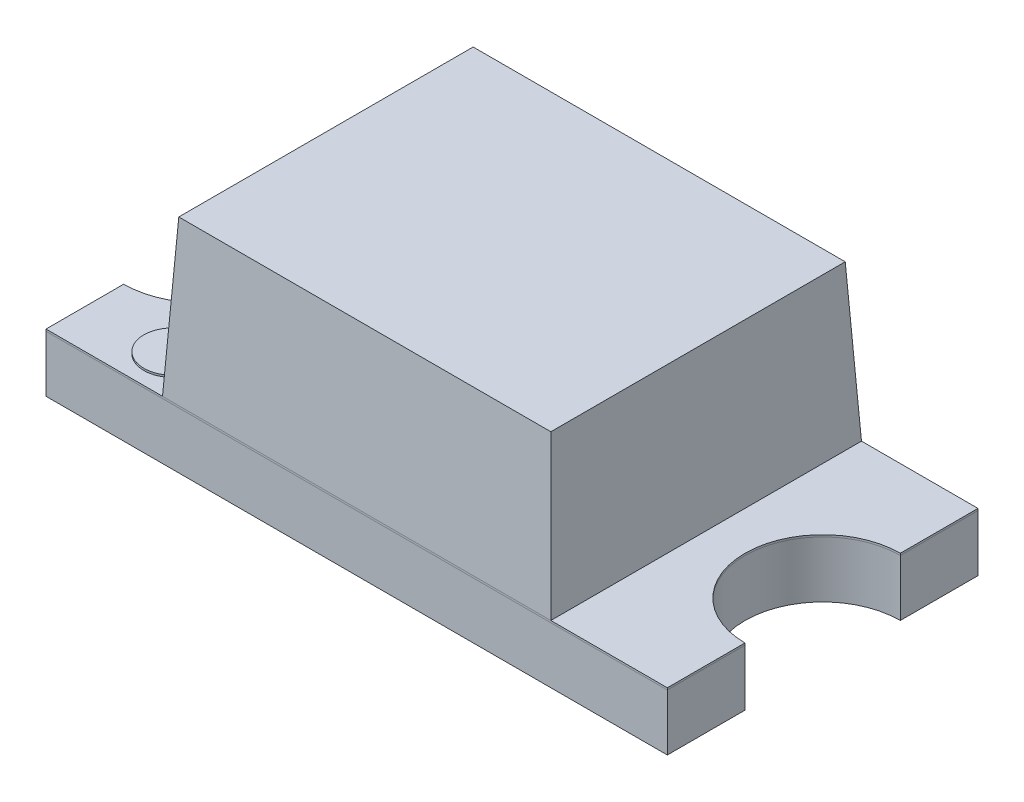
ISO-10303-21;
HEADER;
FILE_DESCRIPTION(('STEP AP214'),'2;1');
FILE_NAME('part.step','',(''),(''),'','','');
FILE_SCHEMA(('AUTOMOTIVE_DESIGN { 1 0 10303 214 1 1 1 1 }'));
ENDSEC;
DATA;
#1=APPLICATION_CONTEXT('core data for automotive mechanical design processes');
#2=APPLICATION_PROTOCOL_DEFINITION('international standard','automotive_design',2000,#1);
#3=PRODUCT_CONTEXT('',#1,'mechanical');
#4=PRODUCT('Part','Part','',(#3));
#5=PRODUCT_RELATED_PRODUCT_CATEGORY('part','',(#4));
#6=PRODUCT_DEFINITION_FORMATION('','',#4);
#7=PRODUCT_DEFINITION_CONTEXT('part definition',#1,'design');
#8=PRODUCT_DEFINITION('design','',#6,#7);
#9=PRODUCT_DEFINITION_SHAPE('','',#8);
#10=(LENGTH_UNIT() NAMED_UNIT(*) SI_UNIT(.MILLI.,.METRE.));
#11=(NAMED_UNIT(*) PLANE_ANGLE_UNIT() SI_UNIT($,.RADIAN.));
#12=(NAMED_UNIT(*) SI_UNIT($,.STERADIAN.) SOLID_ANGLE_UNIT());
#13=UNCERTAINTY_MEASURE_WITH_UNIT(LENGTH_MEASURE(1.E-05),#10,'distance_accuracy_value','');
#14=(GEOMETRIC_REPRESENTATION_CONTEXT(3) GLOBAL_UNCERTAINTY_ASSIGNED_CONTEXT((#13)) GLOBAL_UNIT_ASSIGNED_CONTEXT((#10,
#11,#12)) REPRESENTATION_CONTEXT('',''));
#15=CARTESIAN_POINT('',(0.,0.,0.));
#16=DIRECTION('',(0.,0.,1.));
#17=DIRECTION('',(1.,0.,0.));
#18=AXIS2_PLACEMENT_3D('',#15,#16,#17);
#19=CARTESIAN_POINT('',(-1.651758087201,0.,-0.190154711674));
#20=DIRECTION('',(0.,1.,0.));
#21=DIRECTION('',(0.,0.,1.));
#22=AXIS2_PLACEMENT_3D('',#19,#20,#21);
#23=PLANE('',#22);
#24=DIRECTION('',(0.,0.,1.));
#25=VECTOR('',#24,1.);
#26=CARTESIAN_POINT('',(1.548241912799,0.,-0.990154711674));
#27=LINE('',#26,#25);
#28=CARTESIAN_POINT('',(1.548241912799,0.,-0.990154711674));
#29=VERTEX_POINT('',#28);
#30=CARTESIAN_POINT('',(1.548241912799,0.,-0.590154711674));
#31=VERTEX_POINT('',#30);
#32=EDGE_CURVE('P0_E157',#29,#31,#27,.T.);
#33=ORIENTED_EDGE('',*,*,#32,.T.);
#34=CARTESIAN_POINT('',(1.548241912799,0.,-0.190154711674));
#35=DIRECTION('',(0.,-1.,0.));
#36=DIRECTION('',(0.,0.,-1.));
#37=AXIS2_PLACEMENT_3D('',#34,#35,#36);
#38=CIRCLE('',#37,0.4);
#39=CARTESIAN_POINT('',(1.548241912799,0.,0.209845288326));
#40=VERTEX_POINT('',#39);
#41=EDGE_CURVE('P0_E20',#40,#31,#38,.T.);
#42=ORIENTED_EDGE('',*,*,#41,.F.);
#43=DIRECTION('',(0.,0.,1.));
#44=VECTOR('',#43,1.);
#45=CARTESIAN_POINT('',(1.548241912799,0.,-0.190154711674));
#46=LINE('',#45,#44);
#47=CARTESIAN_POINT('',(1.548241912799,0.,0.609845288326));
#48=VERTEX_POINT('',#47);
#49=EDGE_CURVE('P0_E66',#48,#40,#46,.F.);
#50=ORIENTED_EDGE('',*,*,#49,.F.);
#51=DIRECTION('',(-1.,0.,0.));
#52=VECTOR('',#51,1.);
#53=CARTESIAN_POINT('',(-1.651758087201,0.,0.609845288326));
#54=LINE('',#53,#52);
#55=CARTESIAN_POINT('',(-1.651758087201,0.,0.609845288326));
#56=VERTEX_POINT('',#55);
#57=EDGE_CURVE('P0_E98',#48,#56,#54,.T.);
#58=ORIENTED_EDGE('',*,*,#57,.T.);
#59=DIRECTION('',(0.,0.,-1.));
#60=VECTOR('',#59,1.);
#61=CARTESIAN_POINT('',(-1.651758087201,0.,0.209845288326));
#62=LINE('',#61,#60);
#63=CARTESIAN_POINT('',(-1.651758087201,0.,0.209845288326));
#64=VERTEX_POINT('',#63);
#65=EDGE_CURVE('P0_E94',#56,#64,#62,.T.);
#66=ORIENTED_EDGE('',*,*,#65,.T.);
#67=CARTESIAN_POINT('',(-1.651758087201,0.,-0.190154711674));
#68=DIRECTION('',(0.,-1.,0.));
#69=DIRECTION('',(0.,0.,-1.));
#70=AXIS2_PLACEMENT_3D('',#67,#68,#69);
#71=CIRCLE('',#70,0.4);
#72=CARTESIAN_POINT('',(-1.651758087201,0.,-0.590154711674));
#73=VERTEX_POINT('',#72);
#74=EDGE_CURVE('P0_E143',#64,#73,#71,.F.);
#75=ORIENTED_EDGE('',*,*,#74,.T.);
#76=DIRECTION('',(0.,0.,-1.));
#77=VECTOR('',#76,1.);
#78=CARTESIAN_POINT('',(-1.651758087201,0.,-0.990154711674));
#79=LINE('',#78,#77);
#80=CARTESIAN_POINT('',(-1.651758087201,0.,-0.990154711674));
#81=VERTEX_POINT('',#80);
#82=EDGE_CURVE('P0_E146',#73,#81,#79,.T.);
#83=ORIENTED_EDGE('',*,*,#82,.T.);
#84=DIRECTION('',(1.,0.,0.));
#85=VECTOR('',#84,1.);
#86=CARTESIAN_POINT('',(-1.651758087201,0.,-0.990154711674));
#87=LINE('',#86,#85);
#88=EDGE_CURVE('P0_E72',#81,#29,#87,.T.);
#89=ORIENTED_EDGE('',*,*,#88,.T.);
#90=EDGE_LOOP('',(#33,#42,#50,#58,#66,#75,#83,#89));
#91=FACE_BOUND('',#90,.T.);
#92=ADVANCED_FACE('P0_F17',(#91),#23,.F.);
#93=CARTESIAN_POINT('',(1.548241912799,0.3,-0.990154711674));
#94=DIRECTION('',(-1.,0.,0.));
#95=DIRECTION('',(0.,0.,1.));
#96=AXIS2_PLACEMENT_3D('',#93,#94,#95);
#97=PLANE('',#96);
#98=ORIENTED_EDGE('',*,*,#32,.F.);
#99=DIRECTION('',(0.,1.,0.));
#100=VECTOR('',#99,1.);
#101=CARTESIAN_POINT('',(1.548241912799,0.3,-0.990154711674));
#102=LINE('',#101,#100);
#103=CARTESIAN_POINT('',(1.548241912799,0.29,-0.990154711674));
#104=VERTEX_POINT('',#103);
#105=EDGE_CURVE('P0_E153',#29,#104,#102,.T.);
#106=ORIENTED_EDGE('',*,*,#105,.T.);
#107=DIRECTION('',(0.,0.,1.));
#108=VECTOR('',#107,1.);
#109=CARTESIAN_POINT('',(1.548241912799,0.29,-0.190154711674));
#110=LINE('',#109,#108);
#111=CARTESIAN_POINT('',(1.548241912799,0.29,-0.590154711674));
#112=VERTEX_POINT('',#111);
#113=EDGE_CURVE('P0_E123',#112,#104,#110,.F.);
#114=ORIENTED_EDGE('',*,*,#113,.F.);
#115=DIRECTION('',(0.,-1.,0.));
#116=VECTOR('',#115,1.);
#117=CARTESIAN_POINT('',(1.548241912799,0.3,-0.590154711674));
#118=LINE('',#117,#116);
#119=EDGE_CURVE('P0_E129',#112,#31,#118,.T.);
#120=ORIENTED_EDGE('',*,*,#119,.T.);
#121=EDGE_LOOP('',(#98,#106,#114,#120));
#122=FACE_BOUND('',#121,.T.);
#123=ADVANCED_FACE('P0_F189',(#122),#97,.F.);
#124=CARTESIAN_POINT('',(-1.651758087201,0.3,-0.990154711674));
#125=DIRECTION('',(0.,0.,1.));
#126=DIRECTION('',(1.,0.,0.));
#127=AXIS2_PLACEMENT_3D('',#124,#125,#126);
#128=PLANE('',#127);
#129=ORIENTED_EDGE('',*,*,#88,.F.);
#130=DIRECTION('',(0.,1.,0.));
#131=VECTOR('',#130,1.);
#132=CARTESIAN_POINT('',(-1.651758087201,0.3,-0.990154711674));
#133=LINE('',#132,#131);
#134=CARTESIAN_POINT('',(-1.651758087201,0.29,-0.990154711674));
#135=VERTEX_POINT('',#134);
#136=EDGE_CURVE('P0_E144',#81,#135,#133,.T.);
#137=ORIENTED_EDGE('',*,*,#136,.T.);
#138=DIRECTION('',(1.,0.,0.));
#139=VECTOR('',#138,1.);
#140=CARTESIAN_POINT('',(1.548241912799,0.29,-0.990154711674));
#141=LINE('',#140,#139);
#142=EDGE_CURVE('P0_E120',#104,#135,#141,.F.);
#143=ORIENTED_EDGE('',*,*,#142,.F.);
#144=ORIENTED_EDGE('',*,*,#105,.F.);
#145=EDGE_LOOP('',(#129,#137,#143,#144));
#146=FACE_BOUND('',#145,.T.);
#147=ADVANCED_FACE('P0_F187',(#146),#128,.F.);
#148=CARTESIAN_POINT('',(-1.651758087201,0.3,-0.990154711674));
#149=DIRECTION('',(1.,0.,0.));
#150=DIRECTION('',(0.,0.,-1.));
#151=AXIS2_PLACEMENT_3D('',#148,#149,#150);
#152=PLANE('',#151);
#153=ORIENTED_EDGE('',*,*,#82,.F.);
#154=DIRECTION('',(0.,-1.,0.));
#155=VECTOR('',#154,1.);
#156=CARTESIAN_POINT('',(-1.651758087201,0.3,-0.590154711674));
#157=LINE('',#156,#155);
#158=CARTESIAN_POINT('',(-1.651758087201,0.29,-0.590154711674));
#159=VERTEX_POINT('',#158);
#160=EDGE_CURVE('P0_E141',#73,#159,#157,.F.);
#161=ORIENTED_EDGE('',*,*,#160,.T.);
#162=DIRECTION('',(0.,0.,1.));
#163=VECTOR('',#162,1.);
#164=CARTESIAN_POINT('',(-1.651758087201,0.29,-0.190154711674));
#165=LINE('',#164,#163);
#166=EDGE_CURVE('P0_E111',#135,#159,#165,.T.);
#167=ORIENTED_EDGE('',*,*,#166,.F.);
#168=ORIENTED_EDGE('',*,*,#136,.F.);
#169=EDGE_LOOP('',(#153,#161,#167,#168));
#170=FACE_BOUND('',#169,.T.);
#171=ADVANCED_FACE('P0_F181',(#170),#152,.F.);
#172=CARTESIAN_POINT('',(-1.651758087201,0.3,-0.190154711674));
#173=DIRECTION('',(0.,-1.,0.));
#174=DIRECTION('',(0.,0.,-1.));
#175=AXIS2_PLACEMENT_3D('',#172,#173,#174);
#176=CYLINDRICAL_SURFACE('',#175,0.4);
#177=ORIENTED_EDGE('',*,*,#74,.F.);
#178=DIRECTION('',(0.,1.,0.));
#179=VECTOR('',#178,1.);
#180=CARTESIAN_POINT('',(-1.651758087201,0.3,0.209845288326));
#181=LINE('',#180,#179);
#182=CARTESIAN_POINT('',(-1.651758087201,0.29,0.209845288326));
#183=VERTEX_POINT('',#182);
#184=EDGE_CURVE('P0_E139',#64,#183,#181,.T.);
#185=ORIENTED_EDGE('',*,*,#184,.T.);
#186=CARTESIAN_POINT('',(-1.651758087201,0.29,-0.190154711674));
#187=DIRECTION('',(0.,-1.,0.));
#188=DIRECTION('',(0.,0.,-1.));
#189=AXIS2_PLACEMENT_3D('',#186,#187,#188);
#190=CIRCLE('',#189,0.4);
#191=EDGE_CURVE('P0_E109',#159,#183,#190,.T.);
#192=ORIENTED_EDGE('',*,*,#191,.F.);
#193=ORIENTED_EDGE('',*,*,#160,.F.);
#194=EDGE_LOOP('',(#177,#185,#192,#193));
#195=FACE_BOUND('',#194,.T.);
#196=ADVANCED_FACE('P0_F183',(#195),#176,.F.);
#197=CARTESIAN_POINT('',(-1.651758087201,0.3,0.209845288326));
#198=DIRECTION('',(1.,0.,0.));
#199=DIRECTION('',(0.,0.,-1.));
#200=AXIS2_PLACEMENT_3D('',#197,#198,#199);
#201=PLANE('',#200);
#202=ORIENTED_EDGE('',*,*,#65,.F.);
#203=DIRECTION('',(0.,1.,0.));
#204=VECTOR('',#203,1.);
#205=CARTESIAN_POINT('',(-1.651758087201,0.3,0.609845288326));
#206=LINE('',#205,#204);
#207=CARTESIAN_POINT('',(-1.651758087201,0.29,0.609845288326));
#208=VERTEX_POINT('',#207);
#209=EDGE_CURVE('P0_E87',#56,#208,#206,.T.);
#210=ORIENTED_EDGE('',*,*,#209,.T.);
#211=DIRECTION('',(0.,0.,1.));
#212=VECTOR('',#211,1.);
#213=CARTESIAN_POINT('',(-1.651758087201,0.29,-0.190154711674));
#214=LINE('',#213,#212);
#215=EDGE_CURVE('P0_E92',#183,#208,#214,.T.);
#216=ORIENTED_EDGE('',*,*,#215,.F.);
#217=ORIENTED_EDGE('',*,*,#184,.F.);
#218=EDGE_LOOP('',(#202,#210,#216,#217));
#219=FACE_BOUND('',#218,.T.);
#220=ADVANCED_FACE('P0_F89',(#219),#201,.F.);
#221=CARTESIAN_POINT('',(-1.651758087201,0.3,0.609845288326));
#222=DIRECTION('',(0.,0.,-1.));
#223=DIRECTION('',(-1.,0.,0.));
#224=AXIS2_PLACEMENT_3D('',#221,#222,#223);
#225=PLANE('',#224);
#226=ORIENTED_EDGE('',*,*,#57,.F.);
#227=DIRECTION('',(0.,1.,0.));
#228=VECTOR('',#227,1.);
#229=CARTESIAN_POINT('',(1.548241912799,0.3,0.609845288326));
#230=LINE('',#229,#228);
#231=CARTESIAN_POINT('',(1.548241912799,0.29,0.609845288326));
#232=VERTEX_POINT('',#231);
#233=EDGE_CURVE('P0_E97',#48,#232,#230,.T.);
#234=ORIENTED_EDGE('',*,*,#233,.T.);
#235=DIRECTION('',(1.,0.,0.));
#236=VECTOR('',#235,1.);
#237=CARTESIAN_POINT('',(1.548241912799,0.29,0.609845288326));
#238=LINE('',#237,#236);
#239=EDGE_CURVE('P0_E101',#208,#232,#238,.T.);
#240=ORIENTED_EDGE('',*,*,#239,.F.);
#241=ORIENTED_EDGE('',*,*,#209,.F.);
#242=EDGE_LOOP('',(#226,#234,#240,#241));
#243=FACE_BOUND('',#242,.T.);
#244=ADVANCED_FACE('P0_F102',(#243),#225,.F.);
#245=CARTESIAN_POINT('',(1.548241912799,0.3,0.209845288326));
#246=DIRECTION('',(-1.,0.,0.));
#247=DIRECTION('',(0.,0.,1.));
#248=AXIS2_PLACEMENT_3D('',#245,#246,#247);
#249=PLANE('',#248);
#250=ORIENTED_EDGE('',*,*,#49,.T.);
#251=DIRECTION('',(0.,-1.,0.));
#252=VECTOR('',#251,1.);
#253=CARTESIAN_POINT('',(1.548241912799,0.3,0.209845288326));
#254=LINE('',#253,#252);
#255=CARTESIAN_POINT('',(1.548241912799,0.29,0.209845288326));
#256=VERTEX_POINT('',#255);
#257=EDGE_CURVE('P0_E35',#40,#256,#254,.F.);
#258=ORIENTED_EDGE('',*,*,#257,.T.);
#259=DIRECTION('',(0.,0.,1.));
#260=VECTOR('',#259,1.);
#261=CARTESIAN_POINT('',(1.548241912799,0.29,-0.190154711674));
#262=LINE('',#261,#260);
#263=EDGE_CURVE('P0_E26',#232,#256,#262,.F.);
#264=ORIENTED_EDGE('',*,*,#263,.F.);
#265=ORIENTED_EDGE('',*,*,#233,.F.);
#266=EDGE_LOOP('',(#250,#258,#264,#265));
#267=FACE_BOUND('',#266,.T.);
#268=ADVANCED_FACE('P0_F194',(#267),#249,.F.);
#269=CARTESIAN_POINT('',(1.548241912799,0.3,-0.190154711674));
#270=DIRECTION('',(0.,-1.,0.));
#271=DIRECTION('',(0.,0.,-1.));
#272=AXIS2_PLACEMENT_3D('',#269,#270,#271);
#273=CYLINDRICAL_SURFACE('',#272,0.4);
#274=ORIENTED_EDGE('',*,*,#41,.T.);
#275=ORIENTED_EDGE('',*,*,#119,.F.);
#276=CARTESIAN_POINT('',(1.548241912799,0.29,-0.190154711674));
#277=DIRECTION('',(0.,-1.,0.));
#278=DIRECTION('',(0.,0.,-1.));
#279=AXIS2_PLACEMENT_3D('',#276,#277,#278);
#280=CIRCLE('',#279,0.4);
#281=EDGE_CURVE('P0_E11',#256,#112,#280,.T.);
#282=ORIENTED_EDGE('',*,*,#281,.F.);
#283=ORIENTED_EDGE('',*,*,#257,.F.);
#284=EDGE_LOOP('',(#274,#275,#282,#283));
#285=FACE_BOUND('',#284,.T.);
#286=ADVANCED_FACE('P0_F195',(#285),#273,.F.);
#287=CARTESIAN_POINT('',(1.548241912799,0.29,-0.190154711674));
#288=DIRECTION('',(0.,1.,0.));
#289=DIRECTION('',(0.,0.,1.));
#290=AXIS2_PLACEMENT_3D('',#287,#288,#289);
#291=PLANE('',#290);
#292=ORIENTED_EDGE('',*,*,#263,.T.);
#293=ORIENTED_EDGE('',*,*,#281,.T.);
#294=ORIENTED_EDGE('',*,*,#113,.T.);
#295=ORIENTED_EDGE('',*,*,#142,.T.);
#296=ORIENTED_EDGE('',*,*,#166,.T.);
#297=ORIENTED_EDGE('',*,*,#191,.T.);
#298=ORIENTED_EDGE('',*,*,#215,.T.);
#299=ORIENTED_EDGE('',*,*,#239,.T.);
#300=EDGE_LOOP('',(#292,#293,#294,#295,#296,#297,#298,#299));
#301=FACE_BOUND('',#300,.T.);
#302=ADVANCED_FACE('P0_F106',(#301),#291,.T.);
#303=CLOSED_SHELL('',(#92,#123,#147,#171,#196,#220,#244,#268,#286,#302));
#304=MANIFOLD_SOLID_BREP('P0_B1',#303);
#305=CARTESIAN_POINT('',(-1.214532985657,0.31,0.393628401639));
#306=DIRECTION('',(0.,1.,0.));
#307=DIRECTION('',(0.,0.,1.));
#308=AXIS2_PLACEMENT_3D('',#305,#306,#307);
#309=PLANE('',#308);
#310=CARTESIAN_POINT('',(-1.214532985657,0.31,0.393628401639));
#311=DIRECTION('',(0.,-1.,0.));
#312=DIRECTION('',(0.,0.,-1.));
#313=AXIS2_PLACEMENT_3D('',#310,#311,#312);
#314=CIRCLE('',#313,0.149411676227);
#315=CARTESIAN_POINT('',(-1.214532985657,0.31,0.244216725412));
#316=VERTEX_POINT('',#315);
#317=EDGE_CURVE('P1_E20',#316,#316,#314,.T.);
#318=ORIENTED_EDGE('',*,*,#317,.F.);
#319=EDGE_LOOP('',(#318));
#320=FACE_BOUND('',#319,.T.);
#321=ADVANCED_FACE('P1_F17',(#320),#309,.T.);
#322=CARTESIAN_POINT('',(-1.214532985657,0.31,0.393628401639));
#323=DIRECTION('',(0.,-1.,0.));
#324=DIRECTION('',(0.,0.,-1.));
#325=AXIS2_PLACEMENT_3D('',#322,#323,#324);
#326=CYLINDRICAL_SURFACE('',#325,0.149411676227);
#327=ORIENTED_EDGE('',*,*,#317,.T.);
#328=EDGE_LOOP('',(#327));
#329=FACE_BOUND('',#328,.T.);
#330=CARTESIAN_POINT('',(-1.214532985657,0.3,0.393628401639));
#331=DIRECTION('',(0.,-1.,0.));
#332=DIRECTION('',(0.,0.,-1.));
#333=AXIS2_PLACEMENT_3D('',#330,#331,#332);
#334=CIRCLE('',#333,0.149411676227);
#335=CARTESIAN_POINT('',(-1.214532985657,0.3,0.244216725412));
#336=VERTEX_POINT('',#335);
#337=EDGE_CURVE('P1_E116',#336,#336,#334,.T.);
#338=ORIENTED_EDGE('',*,*,#337,.F.);
#339=EDGE_LOOP('',(#338));
#340=FACE_BOUND('',#339,.T.);
#341=ADVANCED_FACE('P1_F238',(#329,#340),#326,.T.);
#342=CARTESIAN_POINT('',(0.,1.1,0.));
#343=DIRECTION('',(0.,1.,0.));
#344=DIRECTION('',(0.,0.,1.));
#345=AXIS2_PLACEMENT_3D('',#342,#343,#344);
#346=PLANE('',#345);
#347=DIRECTION('',(0.,0.,1.));
#348=VECTOR('',#347,1.);
#349=CARTESIAN_POINT('',(-1.00983186377459,1.09999999999998,-0.990154711674));
#350=LINE('',#349,#348);
#351=CARTESIAN_POINT('',(-1.00983186377486,1.09999999999998,0.567919064899589));
#352=VERTEX_POINT('',#351);
#353=CARTESIAN_POINT('',(-1.00983186377479,1.1,-0.948228488247366));
#354=VERTEX_POINT('',#353);
#355=EDGE_CURVE('P1_E200',#352,#354,#350,.F.);
#356=ORIENTED_EDGE('',*,*,#355,.F.);
#357=DIRECTION('',(1.,0.,0.));
#358=VECTOR('',#357,1.);
#359=CARTESIAN_POINT('',(-1.051758087201,1.09999999999998,0.567919064899589));
#360=LINE('',#359,#358);
#361=CARTESIAN_POINT('',(0.906315689372195,1.1,0.567919064899589));
#362=VERTEX_POINT('',#361);
#363=EDGE_CURVE('P1_E180',#362,#352,#360,.F.);
#364=ORIENTED_EDGE('',*,*,#363,.F.);
#365=DIRECTION('',(0.,0.,1.));
#366=VECTOR('',#365,1.);
#367=CARTESIAN_POINT('',(0.906315689372586,1.10000000000003,-0.990154711674));
#368=LINE('',#367,#366);
#369=CARTESIAN_POINT('',(0.906315689372244,1.10000000000003,-0.94822848824744));
#370=VERTEX_POINT('',#369);
#371=EDGE_CURVE('P1_E198',#370,#362,#368,.T.);
#372=ORIENTED_EDGE('',*,*,#371,.F.);
#373=DIRECTION('',(1.,0.,0.));
#374=VECTOR('',#373,1.);
#375=CARTESIAN_POINT('',(-1.051758087201,1.10000000000003,-0.948228488247587));
#376=LINE('',#375,#374);
#377=EDGE_CURVE('P1_E164',#354,#370,#376,.T.);
#378=ORIENTED_EDGE('',*,*,#377,.F.);
#379=EDGE_LOOP('',(#356,#364,#372,#378));
#380=FACE_BOUND('',#379,.T.);
#381=ADVANCED_FACE('P1_F240',(#380),#346,.T.);
#382=CARTESIAN_POINT('',(0.948241912799,0.3,-0.990154711674));
#383=DIRECTION('',(0.998629534754575,0.0523359562429177,0.));
#384=DIRECTION('',(-0.0523359562429177,0.998629534754575,0.));
#385=AXIS2_PLACEMENT_3D('',#382,#383,#384);
#386=PLANE('',#385);
#387=DIRECTION('',(0.,0.,1.));
#388=VECTOR('',#387,1.);
#389=CARTESIAN_POINT('',(0.948241912799,0.3,-0.190154711674));
#390=LINE('',#389,#388);
#391=CARTESIAN_POINT('',(0.948241912799,0.3,-0.990154711674));
#392=VERTEX_POINT('',#391);
#393=CARTESIAN_POINT('',(0.948241912799,0.3,0.609845288326));
#394=VERTEX_POINT('',#393);
#395=EDGE_CURVE('P1_E162',#392,#394,#390,.T.);
#396=ORIENTED_EDGE('',*,*,#395,.F.);
#397=DIRECTION('',(0.0522644276894173,-0.997264688634202,-0.0522644276886859));
#398=VECTOR('',#397,1.);
#399=CARTESIAN_POINT('',(0.906315689372,1.10000000000003,-0.948228488247587));
#400=LINE('',#399,#398);
#401=EDGE_CURVE('P1_E190',#370,#392,#400,.T.);
#402=ORIENTED_EDGE('',*,*,#401,.F.);
#403=ORIENTED_EDGE('',*,*,#371,.T.);
#404=DIRECTION('',(-0.0522644276894206,0.997264688634202,-0.0522644276886859));
#405=VECTOR('',#404,1.);
#406=CARTESIAN_POINT('',(0.948241912799,0.3,0.609845288326));
#407=LINE('',#406,#405);
#408=EDGE_CURVE('P1_E157',#394,#362,#407,.T.);
#409=ORIENTED_EDGE('',*,*,#408,.F.);
#410=EDGE_LOOP('',(#396,#402,#403,#409));
#411=FACE_BOUND('',#410,.T.);
#412=ADVANCED_FACE('P1_F247',(#411),#386,.T.);
#413=CARTESIAN_POINT('',(-1.051758087201,0.3,-0.990154711674));
#414=DIRECTION('',(-0.998629534754575,0.0523359562429177,0.));
#415=DIRECTION('',(-0.0523359562429177,-0.998629534754575,0.));
#416=AXIS2_PLACEMENT_3D('',#413,#414,#415);
#417=PLANE('',#416);
#418=DIRECTION('',(0.,0.,1.));
#419=VECTOR('',#418,1.);
#420=CARTESIAN_POINT('',(-1.051758087201,0.3,-0.190154711674));
#421=LINE('',#420,#419);
#422=CARTESIAN_POINT('',(-1.051758087201,0.3,0.609845288326));
#423=VERTEX_POINT('',#422);
#424=CARTESIAN_POINT('',(-1.051758087201,0.3,-0.990154711674));
#425=VERTEX_POINT('',#424);
#426=EDGE_CURVE('P1_E181',#423,#425,#421,.F.);
#427=ORIENTED_EDGE('',*,*,#426,.F.);
#428=DIRECTION('',(-0.0522644276881771,-0.997264688634267,0.0522644276886894));
#429=VECTOR('',#428,1.);
#430=CARTESIAN_POINT('',(-1.009831863775,1.09999999999998,0.567919064899589));
#431=LINE('',#430,#429);
#432=EDGE_CURVE('P1_E169',#352,#423,#431,.T.);
#433=ORIENTED_EDGE('',*,*,#432,.F.);
#434=ORIENTED_EDGE('',*,*,#355,.T.);
#435=DIRECTION('',(0.0522644276881737,0.997264688634267,0.0522644276886893));
#436=VECTOR('',#435,1.);
#437=CARTESIAN_POINT('',(-1.051758087201,0.3,-0.990154711674));
#438=LINE('',#437,#436);
#439=EDGE_CURVE('P1_E146',#425,#354,#438,.T.);
#440=ORIENTED_EDGE('',*,*,#439,.F.);
#441=EDGE_LOOP('',(#427,#433,#434,#440));
#442=FACE_BOUND('',#441,.T.);
#443=ADVANCED_FACE('P1_F303',(#442),#417,.T.);
#444=CARTESIAN_POINT('',(1.548241912799,0.3,-0.190154711674));
#445=DIRECTION('',(0.,1.,0.));
#446=DIRECTION('',(0.,0.,1.));
#447=AXIS2_PLACEMENT_3D('',#444,#445,#446);
#448=PLANE('',#447);
#449=DIRECTION('',(0.,0.,1.));
#450=VECTOR('',#449,1.);
#451=CARTESIAN_POINT('',(-1.651758087201,0.3,-0.590154711674));
#452=LINE('',#451,#450);
#453=CARTESIAN_POINT('',(-1.651758087201,0.3,-0.590154711674));
#454=VERTEX_POINT('',#453);
#455=CARTESIAN_POINT('',(-1.651758087201,0.3,-0.990154711674));
#456=VERTEX_POINT('',#455);
#457=EDGE_CURVE('P1_E121',#454,#456,#452,.F.);
#458=ORIENTED_EDGE('',*,*,#457,.F.);
#459=CARTESIAN_POINT('',(-1.651758087201,0.3,-0.190154711674));
#460=DIRECTION('',(0.,1.,0.));
#461=DIRECTION('',(0.,0.,1.));
#462=AXIS2_PLACEMENT_3D('',#459,#460,#461);
#463=CIRCLE('',#462,0.4);
#464=CARTESIAN_POINT('',(-1.651758087201,0.3,0.209845288326));
#465=VERTEX_POINT('',#464);
#466=EDGE_CURVE('P1_E102',#454,#465,#463,.F.);
#467=ORIENTED_EDGE('',*,*,#466,.T.);
#468=DIRECTION('',(0.,0.,1.));
#469=VECTOR('',#468,1.);
#470=CARTESIAN_POINT('',(-1.651758087201,0.3,-0.190154711674));
#471=LINE('',#470,#469);
#472=CARTESIAN_POINT('',(-1.651758087201,0.3,0.609845288326));
#473=VERTEX_POINT('',#472);
#474=EDGE_CURVE('P1_E107',#465,#473,#471,.T.);
#475=ORIENTED_EDGE('',*,*,#474,.T.);
#476=DIRECTION('',(1.,0.,0.));
#477=VECTOR('',#476,1.);
#478=CARTESIAN_POINT('',(1.548241912799,0.3,0.609845288326));
#479=LINE('',#478,#477);
#480=EDGE_CURVE('P1_E115',#473,#423,#479,.T.);
#481=ORIENTED_EDGE('',*,*,#480,.T.);
#482=ORIENTED_EDGE('',*,*,#426,.T.);
#483=DIRECTION('',(1.,0.,0.));
#484=VECTOR('',#483,1.);
#485=CARTESIAN_POINT('',(1.548241912799,0.3,-0.990154711674));
#486=LINE('',#485,#484);
#487=EDGE_CURVE('P1_E178',#425,#456,#486,.F.);
#488=ORIENTED_EDGE('',*,*,#487,.T.);
#489=EDGE_LOOP('',(#458,#467,#475,#481,#482,#488));
#490=FACE_BOUND('',#489,.T.);
#491=ORIENTED_EDGE('',*,*,#337,.T.);
#492=EDGE_LOOP('',(#491));
#493=FACE_BOUND('',#492,.T.);
#494=ADVANCED_FACE('P1_F118',(#490,#493),#448,.T.);
#495=CARTESIAN_POINT('',(-1.051758087201,0.3,0.609845288326));
#496=DIRECTION('',(0.,0.0523359562429177,0.998629534754575));
#497=DIRECTION('',(0.,-0.998629534754575,0.0523359562429177));
#498=AXIS2_PLACEMENT_3D('',#495,#496,#497);
#499=PLANE('',#498);
#500=DIRECTION('',(1.,0.,0.));
#501=VECTOR('',#500,1.);
#502=CARTESIAN_POINT('',(-1.651758087201,0.3,0.609845288326));
#503=LINE('',#502,#501);
#504=EDGE_CURVE('P1_E132',#394,#423,#503,.F.);
#505=ORIENTED_EDGE('',*,*,#504,.F.);
#506=ORIENTED_EDGE('',*,*,#408,.T.);
#507=ORIENTED_EDGE('',*,*,#363,.T.);
#508=ORIENTED_EDGE('',*,*,#432,.T.);
#509=EDGE_LOOP('',(#505,#506,#507,#508));
#510=FACE_BOUND('',#509,.T.);
#511=ADVANCED_FACE('P1_F296',(#510),#499,.T.);
#512=CARTESIAN_POINT('',(1.548241912799,0.3,-0.190154711674));
#513=DIRECTION('',(0.,1.,0.));
#514=DIRECTION('',(0.,0.,1.));
#515=AXIS2_PLACEMENT_3D('',#512,#513,#514);
#516=PLANE('',#515);
#517=DIRECTION('',(0.,0.,-1.));
#518=VECTOR('',#517,1.);
#519=CARTESIAN_POINT('',(1.548241912799,0.3,0.609845288326));
#520=LINE('',#519,#518);
#521=CARTESIAN_POINT('',(1.548241912799,0.3,0.209845288326));
#522=VERTEX_POINT('',#521);
#523=CARTESIAN_POINT('',(1.548241912799,0.3,0.609845288326));
#524=VERTEX_POINT('',#523);
#525=EDGE_CURVE('P1_E149',#522,#524,#520,.F.);
#526=ORIENTED_EDGE('',*,*,#525,.F.);
#527=CARTESIAN_POINT('',(1.548241912799,0.3,-0.190154711674));
#528=DIRECTION('',(0.,1.,0.));
#529=DIRECTION('',(0.,0.,1.));
#530=AXIS2_PLACEMENT_3D('',#527,#528,#529);
#531=CIRCLE('',#530,0.4);
#532=CARTESIAN_POINT('',(1.548241912799,0.3,-0.590154711674));
#533=VERTEX_POINT('',#532);
#534=EDGE_CURVE('P1_E232',#522,#533,#531,.F.);
#535=ORIENTED_EDGE('',*,*,#534,.T.);
#536=DIRECTION('',(0.,0.,1.));
#537=VECTOR('',#536,1.);
#538=CARTESIAN_POINT('',(1.548241912799,0.3,-0.190154711674));
#539=LINE('',#538,#537);
#540=CARTESIAN_POINT('',(1.548241912799,0.3,-0.990154711674));
#541=VERTEX_POINT('',#540);
#542=EDGE_CURVE('P1_E154',#533,#541,#539,.F.);
#543=ORIENTED_EDGE('',*,*,#542,.T.);
#544=DIRECTION('',(1.,0.,0.));
#545=VECTOR('',#544,1.);
#546=CARTESIAN_POINT('',(1.548241912799,0.3,-0.990154711674));
#547=LINE('',#546,#545);
#548=EDGE_CURVE('P1_E156',#541,#392,#547,.F.);
#549=ORIENTED_EDGE('',*,*,#548,.T.);
#550=ORIENTED_EDGE('',*,*,#395,.T.);
#551=DIRECTION('',(1.,0.,0.));
#552=VECTOR('',#551,1.);
#553=CARTESIAN_POINT('',(-1.651758087201,0.3,0.609845288326));
#554=LINE('',#553,#552);
#555=EDGE_CURVE('P1_E129',#524,#394,#554,.F.);
#556=ORIENTED_EDGE('',*,*,#555,.F.);
#557=EDGE_LOOP('',(#526,#535,#543,#549,#550,#556));
#558=FACE_BOUND('',#557,.T.);
#559=ADVANCED_FACE('P1_F292',(#558),#516,.T.);
#560=CARTESIAN_POINT('',(-1.051758087201,0.3,-0.990154711674));
#561=DIRECTION('',(0.,0.0523359562429177,-0.998629534754575));
#562=DIRECTION('',(0.,0.998629534754575,0.0523359562429177));
#563=AXIS2_PLACEMENT_3D('',#560,#561,#562);
#564=PLANE('',#563);
#565=DIRECTION('',(-1.,0.,0.));
#566=VECTOR('',#565,1.);
#567=CARTESIAN_POINT('',(-1.651758087201,0.3,-0.990154711674));
#568=LINE('',#567,#566);
#569=EDGE_CURVE('P1_E184',#425,#392,#568,.F.);
#570=ORIENTED_EDGE('',*,*,#569,.F.);
#571=ORIENTED_EDGE('',*,*,#439,.T.);
#572=ORIENTED_EDGE('',*,*,#377,.T.);
#573=ORIENTED_EDGE('',*,*,#401,.T.);
#574=EDGE_LOOP('',(#570,#571,#572,#573));
#575=FACE_BOUND('',#574,.T.);
#576=ADVANCED_FACE('P1_F288',(#575),#564,.T.);
#577=CARTESIAN_POINT('',(-1.651758087201,0.29,-0.590154711674));
#578=DIRECTION('',(-1.,0.,0.));
#579=DIRECTION('',(0.,0.,1.));
#580=AXIS2_PLACEMENT_3D('',#577,#578,#579);
#581=PLANE('',#580);
#582=ORIENTED_EDGE('',*,*,#457,.T.);
#583=DIRECTION('',(0.,1.,0.));
#584=VECTOR('',#583,1.);
#585=CARTESIAN_POINT('',(-1.651758087201,0.29,-0.990154711674));
#586=LINE('',#585,#584);
#587=CARTESIAN_POINT('',(-1.651758087201,0.29,-0.990154711674));
#588=VERTEX_POINT('',#587);
#589=EDGE_CURVE('P1_E139',#588,#456,#586,.T.);
#590=ORIENTED_EDGE('',*,*,#589,.F.);
#591=DIRECTION('',(0.,0.,1.));
#592=VECTOR('',#591,1.);
#593=CARTESIAN_POINT('',(-1.651758087201,0.29,-0.190154711674));
#594=LINE('',#593,#592);
#595=CARTESIAN_POINT('',(-1.651758087201,0.29,-0.590154711674));
#596=VERTEX_POINT('',#595);
#597=EDGE_CURVE('P1_E142',#588,#596,#594,.T.);
#598=ORIENTED_EDGE('',*,*,#597,.T.);
#599=DIRECTION('',(0.,1.,0.));
#600=VECTOR('',#599,1.);
#601=CARTESIAN_POINT('',(-1.651758087201,0.29,-0.590154711674));
#602=LINE('',#601,#600);
#603=EDGE_CURVE('P1_E123',#596,#454,#602,.T.);
#604=ORIENTED_EDGE('',*,*,#603,.T.);
#605=EDGE_LOOP('',(#582,#590,#598,#604));
#606=FACE_BOUND('',#605,.T.);
#607=ADVANCED_FACE('P1_F285',(#606),#581,.T.);
#608=CARTESIAN_POINT('',(-1.651758087201,0.29,-0.190154711674));
#609=DIRECTION('',(0.,1.,0.));
#610=DIRECTION('',(0.,0.,1.));
#611=AXIS2_PLACEMENT_3D('',#608,#609,#610);
#612=CYLINDRICAL_SURFACE('',#611,0.4);
#613=CARTESIAN_POINT('',(-1.651758087201,0.29,-0.190154711674));
#614=DIRECTION('',(0.,1.,0.));
#615=DIRECTION('',(0.,0.,1.));
#616=AXIS2_PLACEMENT_3D('',#613,#614,#615);
#617=CIRCLE('',#616,0.4);
#618=CARTESIAN_POINT('',(-1.651758087201,0.29,0.209845288326));
#619=VERTEX_POINT('',#618);
#620=EDGE_CURVE('P1_E128',#596,#619,#617,.F.);
#621=ORIENTED_EDGE('',*,*,#620,.T.);
#622=DIRECTION('',(0.,1.,0.));
#623=VECTOR('',#622,1.);
#624=CARTESIAN_POINT('',(-1.651758087201,0.29,0.209845288326));
#625=LINE('',#624,#623);
#626=EDGE_CURVE('P1_E110',#465,#619,#625,.F.);
#627=ORIENTED_EDGE('',*,*,#626,.F.);
#628=ORIENTED_EDGE('',*,*,#466,.F.);
#629=ORIENTED_EDGE('',*,*,#603,.F.);
#630=EDGE_LOOP('',(#621,#627,#628,#629));
#631=FACE_BOUND('',#630,.T.);
#632=ADVANCED_FACE('P1_F126',(#631),#612,.F.);
#633=CARTESIAN_POINT('',(-1.651758087201,0.29,0.209845288326));
#634=DIRECTION('',(-1.,0.,0.));
#635=DIRECTION('',(0.,0.,1.));
#636=AXIS2_PLACEMENT_3D('',#633,#634,#635);
#637=PLANE('',#636);
#638=ORIENTED_EDGE('',*,*,#474,.F.);
#639=ORIENTED_EDGE('',*,*,#626,.T.);
#640=DIRECTION('',(0.,0.,1.));
#641=VECTOR('',#640,1.);
#642=CARTESIAN_POINT('',(-1.651758087201,0.29,-0.190154711674));
#643=LINE('',#642,#641);
#644=CARTESIAN_POINT('',(-1.651758087201,0.29,0.609845288326));
#645=VERTEX_POINT('',#644);
#646=EDGE_CURVE('P1_E231',#619,#645,#643,.T.);
#647=ORIENTED_EDGE('',*,*,#646,.T.);
#648=DIRECTION('',(0.,1.,0.));
#649=VECTOR('',#648,1.);
#650=CARTESIAN_POINT('',(-1.651758087201,0.29,0.609845288326));
#651=LINE('',#650,#649);
#652=EDGE_CURVE('P1_E112',#473,#645,#651,.F.);
#653=ORIENTED_EDGE('',*,*,#652,.F.);
#654=EDGE_LOOP('',(#638,#639,#647,#653));
#655=FACE_BOUND('',#654,.T.);
#656=ADVANCED_FACE('P1_F108',(#655),#637,.T.);
#657=CARTESIAN_POINT('',(-1.651758087201,0.29,0.609845288326));
#658=DIRECTION('',(0.,0.,1.));
#659=DIRECTION('',(1.,0.,0.));
#660=AXIS2_PLACEMENT_3D('',#657,#658,#659);
#661=PLANE('',#660);
#662=DIRECTION('',(1.,0.,0.));
#663=VECTOR('',#662,1.);
#664=CARTESIAN_POINT('',(1.548241912799,0.29,0.609845288326));
#665=LINE('',#664,#663);
#666=CARTESIAN_POINT('',(1.548241912799,0.29,0.609845288326));
#667=VERTEX_POINT('',#666);
#668=EDGE_CURVE('P1_E320',#645,#667,#665,.T.);
#669=ORIENTED_EDGE('',*,*,#668,.T.);
#670=DIRECTION('',(0.,1.,0.));
#671=VECTOR('',#670,1.);
#672=CARTESIAN_POINT('',(1.548241912799,0.29,0.609845288326));
#673=LINE('',#672,#671);
#674=EDGE_CURVE('P1_E151',#524,#667,#673,.F.);
#675=ORIENTED_EDGE('',*,*,#674,.F.);
#676=ORIENTED_EDGE('',*,*,#555,.T.);
#677=ORIENTED_EDGE('',*,*,#504,.T.);
#678=ORIENTED_EDGE('',*,*,#480,.F.);
#679=ORIENTED_EDGE('',*,*,#652,.T.);
#680=EDGE_LOOP('',(#669,#675,#676,#677,#678,#679));
#681=FACE_BOUND('',#680,.T.);
#682=ADVANCED_FACE('P1_F276',(#681),#661,.T.);
#683=CARTESIAN_POINT('',(1.548241912799,0.29,0.609845288326));
#684=DIRECTION('',(1.,0.,0.));
#685=DIRECTION('',(0.,0.,-1.));
#686=AXIS2_PLACEMENT_3D('',#683,#684,#685);
#687=PLANE('',#686);
#688=ORIENTED_EDGE('',*,*,#525,.T.);
#689=ORIENTED_EDGE('',*,*,#674,.T.);
#690=DIRECTION('',(0.,0.,1.));
#691=VECTOR('',#690,1.);
#692=CARTESIAN_POINT('',(1.548241912799,0.29,-0.190154711674));
#693=LINE('',#692,#691);
#694=CARTESIAN_POINT('',(1.548241912799,0.29,0.209845288326));
#695=VERTEX_POINT('',#694);
#696=EDGE_CURVE('P1_E229',#667,#695,#693,.F.);
#697=ORIENTED_EDGE('',*,*,#696,.T.);
#698=DIRECTION('',(0.,1.,0.));
#699=VECTOR('',#698,1.);
#700=CARTESIAN_POINT('',(1.548241912799,0.29,0.209845288326));
#701=LINE('',#700,#699);
#702=EDGE_CURVE('P1_E234',#695,#522,#701,.T.);
#703=ORIENTED_EDGE('',*,*,#702,.T.);
#704=EDGE_LOOP('',(#688,#689,#697,#703));
#705=FACE_BOUND('',#704,.T.);
#706=ADVANCED_FACE('P1_F272',(#705),#687,.T.);
#707=CARTESIAN_POINT('',(1.548241912799,0.29,-0.190154711674));
#708=DIRECTION('',(0.,1.,0.));
#709=DIRECTION('',(0.,0.,1.));
#710=AXIS2_PLACEMENT_3D('',#707,#708,#709);
#711=CYLINDRICAL_SURFACE('',#710,0.4);
#712=CARTESIAN_POINT('',(1.548241912799,0.29,-0.190154711674));
#713=DIRECTION('',(0.,1.,0.));
#714=DIRECTION('',(0.,0.,1.));
#715=AXIS2_PLACEMENT_3D('',#712,#713,#714);
#716=CIRCLE('',#715,0.4);
#717=CARTESIAN_POINT('',(1.548241912799,0.29,-0.590154711674));
#718=VERTEX_POINT('',#717);
#719=EDGE_CURVE('P1_E226',#695,#718,#716,.F.);
#720=ORIENTED_EDGE('',*,*,#719,.T.);
#721=DIRECTION('',(0.,1.,0.));
#722=VECTOR('',#721,1.);
#723=CARTESIAN_POINT('',(1.548241912799,0.29,-0.590154711674));
#724=LINE('',#723,#722);
#725=EDGE_CURVE('P1_E187',#533,#718,#724,.F.);
#726=ORIENTED_EDGE('',*,*,#725,.F.);
#727=ORIENTED_EDGE('',*,*,#534,.F.);
#728=ORIENTED_EDGE('',*,*,#702,.F.);
#729=EDGE_LOOP('',(#720,#726,#727,#728));
#730=FACE_BOUND('',#729,.T.);
#731=ADVANCED_FACE('P1_F268',(#730),#711,.F.);
#732=CARTESIAN_POINT('',(1.548241912799,0.29,-0.990154711674));
#733=DIRECTION('',(1.,0.,0.));
#734=DIRECTION('',(0.,0.,-1.));
#735=AXIS2_PLACEMENT_3D('',#732,#733,#734);
#736=PLANE('',#735);
#737=ORIENTED_EDGE('',*,*,#542,.F.);
#738=ORIENTED_EDGE('',*,*,#725,.T.);
#739=DIRECTION('',(0.,0.,1.));
#740=VECTOR('',#739,1.);
#741=CARTESIAN_POINT('',(1.548241912799,0.29,-0.190154711674));
#742=LINE('',#741,#740);
#743=CARTESIAN_POINT('',(1.548241912799,0.29,-0.990154711674));
#744=VERTEX_POINT('',#743);
#745=EDGE_CURVE('P1_E26',#718,#744,#742,.F.);
#746=ORIENTED_EDGE('',*,*,#745,.T.);
#747=DIRECTION('',(0.,1.,0.));
#748=VECTOR('',#747,1.);
#749=CARTESIAN_POINT('',(1.548241912799,0.29,-0.990154711674));
#750=LINE('',#749,#748);
#751=EDGE_CURVE('P1_E34',#541,#744,#750,.F.);
#752=ORIENTED_EDGE('',*,*,#751,.F.);
#753=EDGE_LOOP('',(#737,#738,#746,#752));
#754=FACE_BOUND('',#753,.T.);
#755=ADVANCED_FACE('P1_F262',(#754),#736,.T.);
#756=CARTESIAN_POINT('',(-1.651758087201,0.29,-0.990154711674));
#757=DIRECTION('',(0.,0.,-1.));
#758=DIRECTION('',(-1.,0.,0.));
#759=AXIS2_PLACEMENT_3D('',#756,#757,#758);
#760=PLANE('',#759);
#761=DIRECTION('',(1.,0.,0.));
#762=VECTOR('',#761,1.);
#763=CARTESIAN_POINT('',(1.548241912799,0.29,-0.990154711674));
#764=LINE('',#763,#762);
#765=EDGE_CURVE('P1_E11',#744,#588,#764,.F.);
#766=ORIENTED_EDGE('',*,*,#765,.T.);
#767=ORIENTED_EDGE('',*,*,#589,.T.);
#768=ORIENTED_EDGE('',*,*,#487,.F.);
#769=ORIENTED_EDGE('',*,*,#569,.T.);
#770=ORIENTED_EDGE('',*,*,#548,.F.);
#771=ORIENTED_EDGE('',*,*,#751,.T.);
#772=EDGE_LOOP('',(#766,#767,#768,#769,#770,#771));
#773=FACE_BOUND('',#772,.T.);
#774=ADVANCED_FACE('P1_F254',(#773),#760,.T.);
#775=CARTESIAN_POINT('',(1.548241912799,0.29,-0.190154711674));
#776=DIRECTION('',(0.,1.,0.));
#777=DIRECTION('',(0.,0.,1.));
#778=AXIS2_PLACEMENT_3D('',#775,#776,#777);
#779=PLANE('',#778);
#780=ORIENTED_EDGE('',*,*,#745,.F.);
#781=ORIENTED_EDGE('',*,*,#719,.F.);
#782=ORIENTED_EDGE('',*,*,#696,.F.);
#783=ORIENTED_EDGE('',*,*,#668,.F.);
#784=ORIENTED_EDGE('',*,*,#646,.F.);
#785=ORIENTED_EDGE('',*,*,#620,.F.);
#786=ORIENTED_EDGE('',*,*,#597,.F.);
#787=ORIENTED_EDGE('',*,*,#765,.F.);
#788=EDGE_LOOP('',(#780,#781,#782,#783,#784,#785,#786,#787));
#789=FACE_BOUND('',#788,.T.);
#790=ADVANCED_FACE('P1_F252',(#789),#779,.F.);
#791=CLOSED_SHELL('',(#321,#341,#381,#412,#443,#494,#511,#559,#576,#607,#632,#656,#682,#706,
#731,#755,#774,#790));
#792=MANIFOLD_SOLID_BREP('P1_B1',#791);
#793=ADVANCED_BREP_SHAPE_REPRESENTATION('',(#18,#304,#792),#14);
#794=SHAPE_DEFINITION_REPRESENTATION(#9,#793);
ENDSEC;
END-ISO-10303-21;
